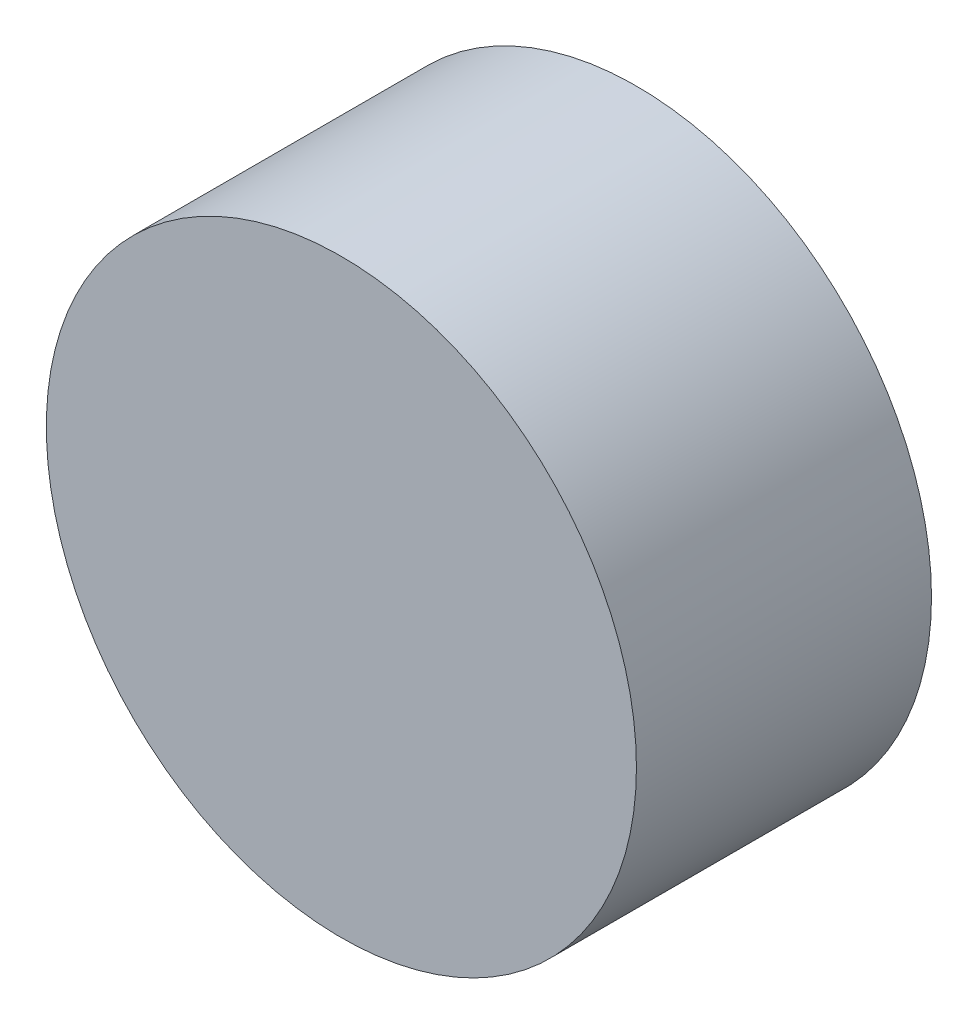
ISO-10303-21;
HEADER;
FILE_DESCRIPTION(('STEP AP214'),'2;1');
FILE_NAME('part.step','',(''),(''),'','','');
FILE_SCHEMA(('AUTOMOTIVE_DESIGN { 1 0 10303 214 1 1 1 1 }'));
ENDSEC;
DATA;
#1=APPLICATION_CONTEXT('core data for automotive mechanical design processes');
#2=APPLICATION_PROTOCOL_DEFINITION('international standard','automotive_design',2000,#1);
#3=PRODUCT_CONTEXT('',#1,'mechanical');
#4=PRODUCT('Part','Part','',(#3));
#5=PRODUCT_RELATED_PRODUCT_CATEGORY('part','',(#4));
#6=PRODUCT_DEFINITION_FORMATION('','',#4);
#7=PRODUCT_DEFINITION_CONTEXT('part definition',#1,'design');
#8=PRODUCT_DEFINITION('design','',#6,#7);
#9=PRODUCT_DEFINITION_SHAPE('','',#8);
#10=(LENGTH_UNIT() NAMED_UNIT(*) SI_UNIT(.MILLI.,.METRE.));
#11=(NAMED_UNIT(*) PLANE_ANGLE_UNIT() SI_UNIT($,.RADIAN.));
#12=(NAMED_UNIT(*) SI_UNIT($,.STERADIAN.) SOLID_ANGLE_UNIT());
#13=UNCERTAINTY_MEASURE_WITH_UNIT(LENGTH_MEASURE(1.E-05),#10,'distance_accuracy_value','');
#14=(GEOMETRIC_REPRESENTATION_CONTEXT(3) GLOBAL_UNCERTAINTY_ASSIGNED_CONTEXT((#13)) GLOBAL_UNIT_ASSIGNED_CONTEXT((#10,
#11,#12)) REPRESENTATION_CONTEXT('',''));
#15=CARTESIAN_POINT('',(0.,0.,0.));
#16=DIRECTION('',(0.,0.,1.));
#17=DIRECTION('',(1.,0.,0.));
#18=AXIS2_PLACEMENT_3D('',#15,#16,#17);
#19=CARTESIAN_POINT('',(0.,0.,30.));
#20=DIRECTION('',(0.,0.,-1.));
#21=DIRECTION('',(-1.,0.,0.));
#22=AXIS2_PLACEMENT_3D('',#19,#20,#21);
#23=CYLINDRICAL_SURFACE('',#22,30.);
#24=CARTESIAN_POINT('',(0.,0.,30.));
#25=DIRECTION('',(0.,0.,1.));
#26=DIRECTION('',(1.,0.,0.));
#27=AXIS2_PLACEMENT_3D('',#24,#25,#26);
#28=CIRCLE('',#27,30.);
#29=CARTESIAN_POINT('',(30.,0.,30.));
#30=VERTEX_POINT('',#29);
#31=EDGE_CURVE('E10',#30,#30,#28,.T.);
#32=ORIENTED_EDGE('',*,*,#31,.F.);
#33=EDGE_LOOP('',(#32));
#34=FACE_BOUND('',#33,.T.);
#35=CARTESIAN_POINT('',(0.,0.,0.));
#36=DIRECTION('',(0.,0.,1.));
#37=DIRECTION('',(1.,0.,0.));
#38=AXIS2_PLACEMENT_3D('',#35,#36,#37);
#39=CIRCLE('',#38,30.);
#40=CARTESIAN_POINT('',(30.,0.,0.));
#41=VERTEX_POINT('',#40);
#42=EDGE_CURVE('E34',#41,#41,#39,.T.);
#43=ORIENTED_EDGE('',*,*,#42,.T.);
#44=EDGE_LOOP('',(#43));
#45=FACE_BOUND('',#44,.T.);
#46=ADVANCED_FACE('F31',(#34,#45),#23,.T.);
#47=CARTESIAN_POINT('',(0.,0.,30.));
#48=DIRECTION('',(0.,0.,1.));
#49=DIRECTION('',(1.,0.,0.));
#50=AXIS2_PLACEMENT_3D('',#47,#48,#49);
#51=PLANE('',#50);
#52=ORIENTED_EDGE('',*,*,#31,.T.);
#53=EDGE_LOOP('',(#52));
#54=FACE_BOUND('',#53,.T.);
#55=ADVANCED_FACE('F46',(#54),#51,.T.);
#56=CARTESIAN_POINT('',(0.,0.,0.));
#57=DIRECTION('',(0.,0.,1.));
#58=DIRECTION('',(1.,0.,0.));
#59=AXIS2_PLACEMENT_3D('',#56,#57,#58);
#60=PLANE('',#59);
#61=ORIENTED_EDGE('',*,*,#42,.F.);
#62=EDGE_LOOP('',(#61));
#63=FACE_BOUND('',#62,.T.);
#64=ADVANCED_FACE('F44',(#63),#60,.F.);
#65=CLOSED_SHELL('',(#46,#55,#64));
#66=MANIFOLD_SOLID_BREP('B2',#65);
#67=ADVANCED_BREP_SHAPE_REPRESENTATION('',(#18,#66),#14);
#68=SHAPE_DEFINITION_REPRESENTATION(#9,#67);
ENDSEC;
END-ISO-10303-21;
